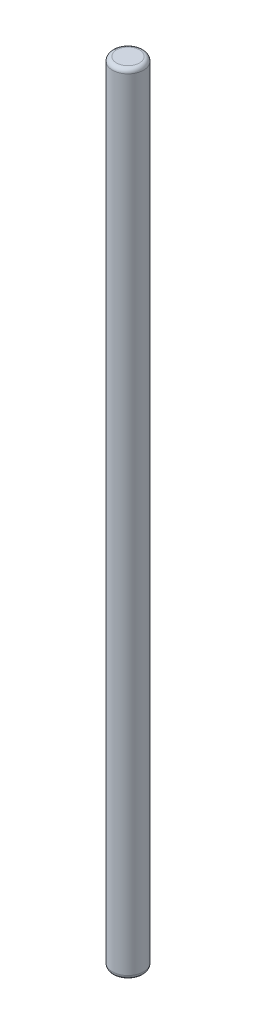
ISO-10303-21;
HEADER;
FILE_DESCRIPTION(('STEP AP214'),'2;1');
FILE_NAME('part.step','',(''),(''),'','','');
FILE_SCHEMA(('AUTOMOTIVE_DESIGN { 1 0 10303 214 1 1 1 1 }'));
ENDSEC;
DATA;
#1=APPLICATION_CONTEXT('core data for automotive mechanical design processes');
#2=APPLICATION_PROTOCOL_DEFINITION('international standard','automotive_design',2000,#1);
#3=PRODUCT_CONTEXT('',#1,'mechanical');
#4=PRODUCT('Part','Part','',(#3));
#5=PRODUCT_RELATED_PRODUCT_CATEGORY('part','',(#4));
#6=PRODUCT_DEFINITION_FORMATION('','',#4);
#7=PRODUCT_DEFINITION_CONTEXT('part definition',#1,'design');
#8=PRODUCT_DEFINITION('design','',#6,#7);
#9=PRODUCT_DEFINITION_SHAPE('','',#8);
#10=(LENGTH_UNIT() NAMED_UNIT(*) SI_UNIT(.MILLI.,.METRE.));
#11=(NAMED_UNIT(*) PLANE_ANGLE_UNIT() SI_UNIT($,.RADIAN.));
#12=(NAMED_UNIT(*) SI_UNIT($,.STERADIAN.) SOLID_ANGLE_UNIT());
#13=UNCERTAINTY_MEASURE_WITH_UNIT(LENGTH_MEASURE(1.E-05),#10,'distance_accuracy_value','');
#14=(GEOMETRIC_REPRESENTATION_CONTEXT(3) GLOBAL_UNCERTAINTY_ASSIGNED_CONTEXT((#13)) GLOBAL_UNIT_ASSIGNED_CONTEXT((#10,
#11,#12)) REPRESENTATION_CONTEXT('',''));
#15=CARTESIAN_POINT('',(0.,0.,0.));
#16=DIRECTION('',(0.,0.,1.));
#17=DIRECTION('',(1.,0.,0.));
#18=AXIS2_PLACEMENT_3D('',#15,#16,#17);
#19=CARTESIAN_POINT('',(0.,38.,0.));
#20=DIRECTION('',(0.,-1.,0.));
#21=DIRECTION('',(0.,0.,-1.));
#22=AXIS2_PLACEMENT_3D('',#19,#20,#21);
#23=CYLINDRICAL_SURFACE('',#22,0.75);
#24=CARTESIAN_POINT('',(0.,0.199999999999999,0.));
#25=DIRECTION('',(0.,1.,0.));
#26=DIRECTION('',(0.,0.,1.));
#27=AXIS2_PLACEMENT_3D('',#24,#25,#26);
#28=CIRCLE('',#27,0.75);
#29=CARTESIAN_POINT('',(0.,0.199999999999999,0.75));
#30=VERTEX_POINT('',#29);
#31=EDGE_CURVE('E43',#30,#30,#28,.T.);
#32=ORIENTED_EDGE('',*,*,#31,.T.);
#33=EDGE_LOOP('',(#32));
#34=FACE_BOUND('',#33,.T.);
#35=CARTESIAN_POINT('',(0.,37.8,0.));
#36=DIRECTION('',(0.,1.,0.));
#37=DIRECTION('',(0.,0.,1.));
#38=AXIS2_PLACEMENT_3D('',#35,#36,#37);
#39=CIRCLE('',#38,0.75);
#40=CARTESIAN_POINT('',(0.,37.8,0.75));
#41=VERTEX_POINT('',#40);
#42=EDGE_CURVE('E47',#41,#41,#39,.F.);
#43=ORIENTED_EDGE('',*,*,#42,.T.);
#44=EDGE_LOOP('',(#43));
#45=FACE_BOUND('',#44,.T.);
#46=ADVANCED_FACE('F32',(#34,#45),#23,.T.);
#47=CARTESIAN_POINT('',(0.,38.,0.));
#48=DIRECTION('',(0.,1.,0.));
#49=DIRECTION('',(0.,0.,1.));
#50=AXIS2_PLACEMENT_3D('',#47,#48,#49);
#51=PLANE('',#50);
#52=CARTESIAN_POINT('',(0.,38.,0.));
#53=DIRECTION('',(0.,1.,0.));
#54=DIRECTION('',(0.,0.,1.));
#55=AXIS2_PLACEMENT_3D('',#52,#53,#54);
#56=CIRCLE('',#55,0.55);
#57=CARTESIAN_POINT('',(0.,38.,0.55));
#58=VERTEX_POINT('',#57);
#59=EDGE_CURVE('E10',#58,#58,#56,.T.);
#60=ORIENTED_EDGE('',*,*,#59,.T.);
#61=EDGE_LOOP('',(#60));
#62=FACE_BOUND('',#61,.T.);
#63=ADVANCED_FACE('F63',(#62),#51,.T.);
#64=CARTESIAN_POINT('',(0.,0.,0.));
#65=DIRECTION('',(0.,1.,0.));
#66=DIRECTION('',(0.,0.,1.));
#67=AXIS2_PLACEMENT_3D('',#64,#65,#66);
#68=PLANE('',#67);
#69=CARTESIAN_POINT('',(0.,0.,0.));
#70=DIRECTION('',(0.,1.,0.));
#71=DIRECTION('',(0.,0.,1.));
#72=AXIS2_PLACEMENT_3D('',#69,#70,#71);
#73=CIRCLE('',#72,0.55);
#74=CARTESIAN_POINT('',(0.,0.,0.55));
#75=VERTEX_POINT('',#74);
#76=EDGE_CURVE('E39',#75,#75,#73,.F.);
#77=ORIENTED_EDGE('',*,*,#76,.T.);
#78=EDGE_LOOP('',(#77));
#79=FACE_BOUND('',#78,.T.);
#80=ADVANCED_FACE('F60',(#79),#68,.F.);
#81=CARTESIAN_POINT('',(0.,0.199999999999999,0.));
#82=DIRECTION('',(0.,1.,0.));
#83=DIRECTION('',(0.,0.,1.));
#84=AXIS2_PLACEMENT_3D('',#81,#82,#83);
#85=TOROIDAL_SURFACE('',#84,0.55,0.2);
#86=ORIENTED_EDGE('',*,*,#76,.F.);
#87=EDGE_LOOP('',(#86));
#88=FACE_BOUND('',#87,.T.);
#89=ORIENTED_EDGE('',*,*,#31,.F.);
#90=EDGE_LOOP('',(#89));
#91=FACE_BOUND('',#90,.T.);
#92=ADVANCED_FACE('F56',(#88,#91),#85,.T.);
#93=CARTESIAN_POINT('',(0.,37.8,0.));
#94=DIRECTION('',(0.,1.,0.));
#95=DIRECTION('',(0.,0.,1.));
#96=AXIS2_PLACEMENT_3D('',#93,#94,#95);
#97=TOROIDAL_SURFACE('',#96,0.55,0.2);
#98=ORIENTED_EDGE('',*,*,#42,.F.);
#99=EDGE_LOOP('',(#98));
#100=FACE_BOUND('',#99,.T.);
#101=ORIENTED_EDGE('',*,*,#59,.F.);
#102=EDGE_LOOP('',(#101));
#103=FACE_BOUND('',#102,.T.);
#104=ADVANCED_FACE('F34',(#100,#103),#97,.T.);
#105=CLOSED_SHELL('',(#46,#63,#80,#92,#104));
#106=MANIFOLD_SOLID_BREP('B2',#105);
#107=ADVANCED_BREP_SHAPE_REPRESENTATION('',(#18,#106),#14);
#108=SHAPE_DEFINITION_REPRESENTATION(#9,#107);
ENDSEC;
END-ISO-10303-21;
